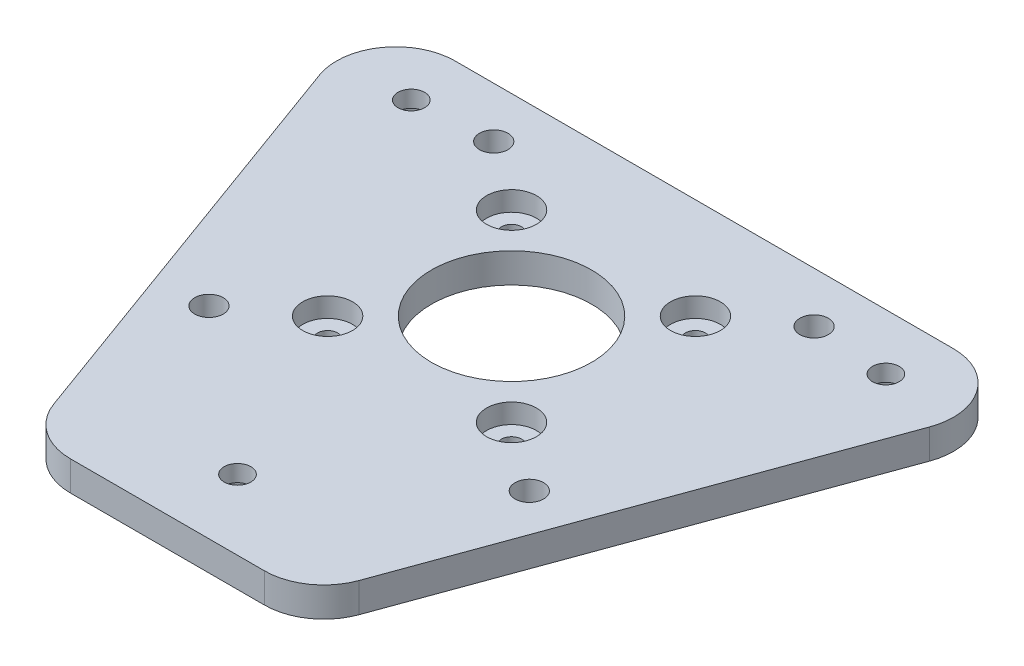
ISO-10303-21;
HEADER;
FILE_DESCRIPTION(('STEP AP214'),'2;1');
FILE_NAME('part.step','',(''),(''),'','','');
FILE_SCHEMA(('AUTOMOTIVE_DESIGN { 1 0 10303 214 1 1 1 1 }'));
ENDSEC;
DATA;
#1=APPLICATION_CONTEXT('core data for automotive mechanical design processes');
#2=APPLICATION_PROTOCOL_DEFINITION('international standard','automotive_design',2000,#1);
#3=PRODUCT_CONTEXT('',#1,'mechanical');
#4=PRODUCT('Part','Part','',(#3));
#5=PRODUCT_RELATED_PRODUCT_CATEGORY('part','',(#4));
#6=PRODUCT_DEFINITION_FORMATION('','',#4);
#7=PRODUCT_DEFINITION_CONTEXT('part definition',#1,'design');
#8=PRODUCT_DEFINITION('design','',#6,#7);
#9=PRODUCT_DEFINITION_SHAPE('','',#8);
#10=(LENGTH_UNIT() NAMED_UNIT(*) SI_UNIT(.MILLI.,.METRE.));
#11=(NAMED_UNIT(*) PLANE_ANGLE_UNIT() SI_UNIT($,.RADIAN.));
#12=(NAMED_UNIT(*) SI_UNIT($,.STERADIAN.) SOLID_ANGLE_UNIT());
#13=UNCERTAINTY_MEASURE_WITH_UNIT(LENGTH_MEASURE(1.E-05),#10,'distance_accuracy_value','');
#14=(GEOMETRIC_REPRESENTATION_CONTEXT(3) GLOBAL_UNCERTAINTY_ASSIGNED_CONTEXT((#13)) GLOBAL_UNIT_ASSIGNED_CONTEXT((#10,
#11,#12)) REPRESENTATION_CONTEXT('',''));
#15=CARTESIAN_POINT('',(0.,0.,0.));
#16=DIRECTION('',(0.,0.,1.));
#17=DIRECTION('',(1.,0.,0.));
#18=AXIS2_PLACEMENT_3D('',#15,#16,#17);
#19=CARTESIAN_POINT('',(0.,5.,0.));
#20=DIRECTION('',(0.,-1.,0.));
#21=DIRECTION('',(0.,0.,-1.));
#22=AXIS2_PLACEMENT_3D('',#19,#20,#21);
#23=PLANE('',#22);
#24=CARTESIAN_POINT('',(0.,5.,46.19));
#25=DIRECTION('',(0.,-1.,0.));
#26=DIRECTION('',(0.,0.,-1.));
#27=AXIS2_PLACEMENT_3D('',#24,#25,#26);
#28=CIRCLE('',#27,2.25);
#29=CARTESIAN_POINT('',(0.,5.,43.94));
#30=VERTEX_POINT('',#29);
#31=EDGE_CURVE('E277',#30,#30,#28,.T.);
#32=ORIENTED_EDGE('',*,*,#31,.T.);
#33=EDGE_LOOP('',(#32));
#34=FACE_BOUND('',#33,.T.);
#35=CARTESIAN_POINT('',(-40.,5.,-23.1));
#36=DIRECTION('',(0.,-1.,0.));
#37=DIRECTION('',(0.,0.,-1.));
#38=AXIS2_PLACEMENT_3D('',#35,#36,#37);
#39=CIRCLE('',#38,2.25);
#40=CARTESIAN_POINT('',(-40.,5.,-25.35));
#41=VERTEX_POINT('',#40);
#42=EDGE_CURVE('E265',#41,#41,#39,.T.);
#43=ORIENTED_EDGE('',*,*,#42,.T.);
#44=EDGE_LOOP('',(#43));
#45=FACE_BOUND('',#44,.T.);
#46=CARTESIAN_POINT('',(40.,5.,-23.1));
#47=DIRECTION('',(0.,-1.,0.));
#48=DIRECTION('',(0.,0.,-1.));
#49=AXIS2_PLACEMENT_3D('',#46,#47,#48);
#50=CIRCLE('',#49,2.25);
#51=CARTESIAN_POINT('',(40.,5.,-25.35));
#52=VERTEX_POINT('',#51);
#53=EDGE_CURVE('E253',#52,#52,#50,.T.);
#54=ORIENTED_EDGE('',*,*,#53,.T.);
#55=EDGE_LOOP('',(#54));
#56=FACE_BOUND('',#55,.T.);
#57=CARTESIAN_POINT('',(-15.5,5.,-15.5));
#58=DIRECTION('',(0.,1.,0.));
#59=DIRECTION('',(0.,0.,1.));
#60=AXIS2_PLACEMENT_3D('',#57,#58,#59);
#61=CIRCLE('',#60,4.2);
#62=CARTESIAN_POINT('',(-15.5,5.,-11.3));
#63=VERTEX_POINT('',#62);
#64=EDGE_CURVE('E250',#63,#63,#61,.T.);
#65=ORIENTED_EDGE('',*,*,#64,.F.);
#66=EDGE_LOOP('',(#65));
#67=FACE_BOUND('',#66,.T.);
#68=CARTESIAN_POINT('',(15.5,5.,-15.5));
#69=DIRECTION('',(0.,1.,0.));
#70=DIRECTION('',(0.,0.,1.));
#71=AXIS2_PLACEMENT_3D('',#68,#69,#70);
#72=CIRCLE('',#71,4.2);
#73=CARTESIAN_POINT('',(15.5,5.,-11.3));
#74=VERTEX_POINT('',#73);
#75=EDGE_CURVE('E238',#74,#74,#72,.T.);
#76=ORIENTED_EDGE('',*,*,#75,.F.);
#77=EDGE_LOOP('',(#76));
#78=FACE_BOUND('',#77,.T.);
#79=CARTESIAN_POINT('',(-15.5,5.,15.5));
#80=DIRECTION('',(0.,1.,0.));
#81=DIRECTION('',(0.,0.,1.));
#82=AXIS2_PLACEMENT_3D('',#79,#80,#81);
#83=CIRCLE('',#82,4.2);
#84=CARTESIAN_POINT('',(-15.5,5.,19.7));
#85=VERTEX_POINT('',#84);
#86=EDGE_CURVE('E214',#85,#85,#83,.T.);
#87=ORIENTED_EDGE('',*,*,#86,.F.);
#88=EDGE_LOOP('',(#87));
#89=FACE_BOUND('',#88,.T.);
#90=CARTESIAN_POINT('',(0.,5.,0.));
#91=DIRECTION('',(0.,1.,0.));
#92=DIRECTION('',(0.,0.,1.));
#93=AXIS2_PLACEMENT_3D('',#90,#91,#92);
#94=CIRCLE('',#93,13.5);
#95=CARTESIAN_POINT('',(0.,5.,13.5));
#96=VERTEX_POINT('',#95);
#97=EDGE_CURVE('E39',#96,#96,#94,.T.);
#98=ORIENTED_EDGE('',*,*,#97,.F.);
#99=EDGE_LOOP('',(#98));
#100=FACE_BOUND('',#99,.T.);
#101=CARTESIAN_POINT('',(-16.3480951115046,5.,48.));
#102=DIRECTION('',(0.,1.,0.));
#103=DIRECTION('',(0.,0.,1.));
#104=AXIS2_PLACEMENT_3D('',#101,#102,#103);
#105=CIRCLE('',#104,10.);
#106=CARTESIAN_POINT('',(-25.7449430600682,5.,51.4204164412504));
#107=VERTEX_POINT('',#106);
#108=CARTESIAN_POINT('',(-16.3480951115045,5.,58.));
#109=VERTEX_POINT('',#108);
#110=EDGE_CURVE('E136',#107,#109,#105,.T.);
#111=ORIENTED_EDGE('',*,*,#110,.T.);
#112=DIRECTION('',(1.,0.,0.));
#113=VECTOR('',#112,1.);
#114=CARTESIAN_POINT('',(-16.3480951115045,5.,58.));
#115=LINE('',#114,#113);
#116=CARTESIAN_POINT('',(16.3480951115045,5.,58.));
#117=VERTEX_POINT('',#116);
#118=EDGE_CURVE('E139',#109,#117,#115,.T.);
#119=ORIENTED_EDGE('',*,*,#118,.T.);
#120=CARTESIAN_POINT('',(16.3480951115046,5.,48.));
#121=DIRECTION('',(0.,1.,0.));
#122=DIRECTION('',(0.,0.,-1.));
#123=AXIS2_PLACEMENT_3D('',#120,#121,#122);
#124=CIRCLE('',#123,10.);
#125=CARTESIAN_POINT('',(25.7449430600682,5.,51.4204164412504));
#126=VERTEX_POINT('',#125);
#127=EDGE_CURVE('E50',#117,#126,#124,.T.);
#128=ORIENTED_EDGE('',*,*,#127,.T.);
#129=DIRECTION('',(0.342041644125043,0.,-0.939684794856359));
#130=VECTOR('',#129,1.);
#131=CARTESIAN_POINT('',(51.4066713787663,5.,-19.0795835587496));
#132=LINE('',#131,#130);
#133=CARTESIAN_POINT('',(51.4066713787663,5.,-19.0795835587496));
#134=VERTEX_POINT('',#133);
#135=EDGE_CURVE('E107',#126,#134,#132,.T.);
#136=ORIENTED_EDGE('',*,*,#135,.T.);
#137=CARTESIAN_POINT('',(42.0098234302028,5.,-22.5000000000001));
#138=DIRECTION('',(0.,1.,0.));
#139=DIRECTION('',(0.,0.,1.));
#140=AXIS2_PLACEMENT_3D('',#137,#138,#139);
#141=CIRCLE('',#140,10.);
#142=CARTESIAN_POINT('',(42.0098234302027,5.,-32.5000000000001));
#143=VERTEX_POINT('',#142);
#144=EDGE_CURVE('E145',#134,#143,#141,.T.);
#145=ORIENTED_EDGE('',*,*,#144,.T.);
#146=DIRECTION('',(-1.,0.,0.));
#147=VECTOR('',#146,1.);
#148=CARTESIAN_POINT('',(-42.0098234302027,5.,-32.5000000000001));
#149=LINE('',#148,#147);
#150=CARTESIAN_POINT('',(-42.0098234302028,5.,-32.5000000000001));
#151=VERTEX_POINT('',#150);
#152=EDGE_CURVE('E148',#143,#151,#149,.T.);
#153=ORIENTED_EDGE('',*,*,#152,.T.);
#154=CARTESIAN_POINT('',(-42.0098234302028,5.,-22.5000000000001));
#155=DIRECTION('',(0.,1.,0.));
#156=DIRECTION('',(0.,0.,-1.));
#157=AXIS2_PLACEMENT_3D('',#154,#155,#156);
#158=CIRCLE('',#157,10.);
#159=CARTESIAN_POINT('',(-51.4066713787663,5.,-19.0795835587496));
#160=VERTEX_POINT('',#159);
#161=EDGE_CURVE('E151',#151,#160,#158,.T.);
#162=ORIENTED_EDGE('',*,*,#161,.T.);
#163=DIRECTION('',(0.342041644125043,0.,0.939684794856359));
#164=VECTOR('',#163,1.);
#165=CARTESIAN_POINT('',(-51.4066713787663,5.,-19.0795835587496));
#166=LINE('',#165,#164);
#167=EDGE_CURVE('E154',#160,#107,#166,.T.);
#168=ORIENTED_EDGE('',*,*,#167,.T.);
#169=EDGE_LOOP('',(#111,#119,#128,#136,#145,#153,#162,#168));
#170=FACE_BOUND('',#169,.T.);
#171=CARTESIAN_POINT('',(-27.,5.,24.));
#172=DIRECTION('',(0.,1.,0.));
#173=DIRECTION('',(0.,0.,1.));
#174=AXIS2_PLACEMENT_3D('',#171,#172,#173);
#175=CIRCLE('',#174,2.4);
#176=CARTESIAN_POINT('',(-27.,5.,26.4));
#177=VERTEX_POINT('',#176);
#178=EDGE_CURVE('E184',#177,#177,#175,.T.);
#179=ORIENTED_EDGE('',*,*,#178,.F.);
#180=EDGE_LOOP('',(#179));
#181=FACE_BOUND('',#180,.T.);
#182=CARTESIAN_POINT('',(27.,5.,24.));
#183=DIRECTION('',(0.,1.,0.));
#184=DIRECTION('',(0.,0.,1.));
#185=AXIS2_PLACEMENT_3D('',#182,#183,#184);
#186=CIRCLE('',#185,2.4);
#187=CARTESIAN_POINT('',(27.,5.,26.4));
#188=VERTEX_POINT('',#187);
#189=EDGE_CURVE('E190',#188,#188,#186,.T.);
#190=ORIENTED_EDGE('',*,*,#189,.F.);
#191=EDGE_LOOP('',(#190));
#192=FACE_BOUND('',#191,.T.);
#193=CARTESIAN_POINT('',(27.,5.,-24.0000000000001));
#194=DIRECTION('',(0.,1.,0.));
#195=DIRECTION('',(0.,0.,1.));
#196=AXIS2_PLACEMENT_3D('',#193,#194,#195);
#197=CIRCLE('',#196,2.4);
#198=CARTESIAN_POINT('',(27.,5.,-21.6000000000001));
#199=VERTEX_POINT('',#198);
#200=EDGE_CURVE('E196',#199,#199,#197,.T.);
#201=ORIENTED_EDGE('',*,*,#200,.F.);
#202=EDGE_LOOP('',(#201));
#203=FACE_BOUND('',#202,.T.);
#204=CARTESIAN_POINT('',(-27.,5.,-24.0000000000001));
#205=DIRECTION('',(0.,1.,0.));
#206=DIRECTION('',(0.,0.,1.));
#207=AXIS2_PLACEMENT_3D('',#204,#205,#206);
#208=CIRCLE('',#207,2.4);
#209=CARTESIAN_POINT('',(-27.,5.,-21.6000000000001));
#210=VERTEX_POINT('',#209);
#211=EDGE_CURVE('E202',#210,#210,#208,.T.);
#212=ORIENTED_EDGE('',*,*,#211,.F.);
#213=EDGE_LOOP('',(#212));
#214=FACE_BOUND('',#213,.T.);
#215=CARTESIAN_POINT('',(15.5,5.,15.5));
#216=DIRECTION('',(0.,1.,0.));
#217=DIRECTION('',(0.,0.,1.));
#218=AXIS2_PLACEMENT_3D('',#215,#216,#217);
#219=CIRCLE('',#218,4.2);
#220=CARTESIAN_POINT('',(15.5,5.,19.7));
#221=VERTEX_POINT('',#220);
#222=EDGE_CURVE('E226',#221,#221,#219,.T.);
#223=ORIENTED_EDGE('',*,*,#222,.F.);
#224=EDGE_LOOP('',(#223));
#225=FACE_BOUND('',#224,.T.);
#226=ADVANCED_FACE('F35',(#34,#45,#56,#67,#78,#89,#100,#170,#181,#192,#203,#214,#225),#23,.F.);
#227=CARTESIAN_POINT('',(0.,0.,0.));
#228=DIRECTION('',(0.,-1.,0.));
#229=DIRECTION('',(0.,0.,-1.));
#230=AXIS2_PLACEMENT_3D('',#227,#228,#229);
#231=PLANE('',#230);
#232=CARTESIAN_POINT('',(0.,0.,46.19));
#233=DIRECTION('',(0.,-1.,0.));
#234=DIRECTION('',(0.,0.,-1.));
#235=AXIS2_PLACEMENT_3D('',#232,#233,#234);
#236=CIRCLE('',#235,4.3);
#237=CARTESIAN_POINT('',(0.,0.,41.89));
#238=VERTEX_POINT('',#237);
#239=EDGE_CURVE('E286',#238,#238,#236,.T.);
#240=ORIENTED_EDGE('',*,*,#239,.F.);
#241=EDGE_LOOP('',(#240));
#242=FACE_BOUND('',#241,.T.);
#243=CARTESIAN_POINT('',(-40.,0.,-23.1));
#244=DIRECTION('',(0.,-1.,0.));
#245=DIRECTION('',(0.,0.,-1.));
#246=AXIS2_PLACEMENT_3D('',#243,#244,#245);
#247=CIRCLE('',#246,4.3);
#248=CARTESIAN_POINT('',(-40.,0.,-27.4));
#249=VERTEX_POINT('',#248);
#250=EDGE_CURVE('E274',#249,#249,#247,.T.);
#251=ORIENTED_EDGE('',*,*,#250,.F.);
#252=EDGE_LOOP('',(#251));
#253=FACE_BOUND('',#252,.T.);
#254=CARTESIAN_POINT('',(40.,0.,-23.1));
#255=DIRECTION('',(0.,-1.,0.));
#256=DIRECTION('',(0.,0.,-1.));
#257=AXIS2_PLACEMENT_3D('',#254,#255,#256);
#258=CIRCLE('',#257,4.3);
#259=CARTESIAN_POINT('',(40.,0.,-27.4));
#260=VERTEX_POINT('',#259);
#261=EDGE_CURVE('E262',#260,#260,#258,.T.);
#262=ORIENTED_EDGE('',*,*,#261,.F.);
#263=EDGE_LOOP('',(#262));
#264=FACE_BOUND('',#263,.T.);
#265=CARTESIAN_POINT('',(-15.5,0.,-15.5));
#266=DIRECTION('',(0.,-1.,0.));
#267=DIRECTION('',(0.,0.,-1.));
#268=AXIS2_PLACEMENT_3D('',#265,#266,#267);
#269=CIRCLE('',#268,1.7);
#270=CARTESIAN_POINT('',(-15.5,0.,-17.2));
#271=VERTEX_POINT('',#270);
#272=EDGE_CURVE('E241',#271,#271,#269,.T.);
#273=ORIENTED_EDGE('',*,*,#272,.F.);
#274=EDGE_LOOP('',(#273));
#275=FACE_BOUND('',#274,.T.);
#276=CARTESIAN_POINT('',(15.5,0.,-15.5));
#277=DIRECTION('',(0.,-1.,0.));
#278=DIRECTION('',(0.,0.,-1.));
#279=AXIS2_PLACEMENT_3D('',#276,#277,#278);
#280=CIRCLE('',#279,1.7);
#281=CARTESIAN_POINT('',(15.5,0.,-17.2));
#282=VERTEX_POINT('',#281);
#283=EDGE_CURVE('E229',#282,#282,#280,.T.);
#284=ORIENTED_EDGE('',*,*,#283,.F.);
#285=EDGE_LOOP('',(#284));
#286=FACE_BOUND('',#285,.T.);
#287=CARTESIAN_POINT('',(15.5,0.,15.5));
#288=DIRECTION('',(0.,-1.,0.));
#289=DIRECTION('',(0.,0.,-1.));
#290=AXIS2_PLACEMENT_3D('',#287,#288,#289);
#291=CIRCLE('',#290,1.7);
#292=CARTESIAN_POINT('',(15.5,0.,13.8));
#293=VERTEX_POINT('',#292);
#294=EDGE_CURVE('E217',#293,#293,#291,.T.);
#295=ORIENTED_EDGE('',*,*,#294,.F.);
#296=EDGE_LOOP('',(#295));
#297=FACE_BOUND('',#296,.T.);
#298=CARTESIAN_POINT('',(-15.5,0.,15.5));
#299=DIRECTION('',(0.,-1.,0.));
#300=DIRECTION('',(0.,0.,-1.));
#301=AXIS2_PLACEMENT_3D('',#298,#299,#300);
#302=CIRCLE('',#301,1.7);
#303=CARTESIAN_POINT('',(-15.5,0.,13.8));
#304=VERTEX_POINT('',#303);
#305=EDGE_CURVE('E205',#304,#304,#302,.T.);
#306=ORIENTED_EDGE('',*,*,#305,.F.);
#307=EDGE_LOOP('',(#306));
#308=FACE_BOUND('',#307,.T.);
#309=CARTESIAN_POINT('',(-27.,0.,-24.0000000000001));
#310=DIRECTION('',(0.,-1.,0.));
#311=DIRECTION('',(0.,0.,-1.));
#312=AXIS2_PLACEMENT_3D('',#309,#310,#311);
#313=CIRCLE('',#312,2.4);
#314=CARTESIAN_POINT('',(-27.,0.,-26.4000000000001));
#315=VERTEX_POINT('',#314);
#316=EDGE_CURVE('E199',#315,#315,#313,.T.);
#317=ORIENTED_EDGE('',*,*,#316,.F.);
#318=EDGE_LOOP('',(#317));
#319=FACE_BOUND('',#318,.T.);
#320=CARTESIAN_POINT('',(27.,0.,-24.0000000000001));
#321=DIRECTION('',(0.,-1.,0.));
#322=DIRECTION('',(0.,0.,-1.));
#323=AXIS2_PLACEMENT_3D('',#320,#321,#322);
#324=CIRCLE('',#323,2.4);
#325=CARTESIAN_POINT('',(27.,0.,-26.4000000000001));
#326=VERTEX_POINT('',#325);
#327=EDGE_CURVE('E193',#326,#326,#324,.T.);
#328=ORIENTED_EDGE('',*,*,#327,.F.);
#329=EDGE_LOOP('',(#328));
#330=FACE_BOUND('',#329,.T.);
#331=CARTESIAN_POINT('',(27.,0.,24.));
#332=DIRECTION('',(0.,-1.,0.));
#333=DIRECTION('',(0.,0.,-1.));
#334=AXIS2_PLACEMENT_3D('',#331,#332,#333);
#335=CIRCLE('',#334,2.4);
#336=CARTESIAN_POINT('',(27.,0.,21.6));
#337=VERTEX_POINT('',#336);
#338=EDGE_CURVE('E187',#337,#337,#335,.T.);
#339=ORIENTED_EDGE('',*,*,#338,.F.);
#340=EDGE_LOOP('',(#339));
#341=FACE_BOUND('',#340,.T.);
#342=CARTESIAN_POINT('',(-27.,0.,24.));
#343=DIRECTION('',(0.,-1.,0.));
#344=DIRECTION('',(0.,0.,-1.));
#345=AXIS2_PLACEMENT_3D('',#342,#343,#344);
#346=CIRCLE('',#345,2.4);
#347=CARTESIAN_POINT('',(-27.,0.,21.6));
#348=VERTEX_POINT('',#347);
#349=EDGE_CURVE('E140',#348,#348,#346,.T.);
#350=ORIENTED_EDGE('',*,*,#349,.F.);
#351=EDGE_LOOP('',(#350));
#352=FACE_BOUND('',#351,.T.);
#353=CARTESIAN_POINT('',(0.,0.,0.));
#354=DIRECTION('',(0.,1.,0.));
#355=DIRECTION('',(0.,0.,1.));
#356=AXIS2_PLACEMENT_3D('',#353,#354,#355);
#357=CIRCLE('',#356,13.5);
#358=CARTESIAN_POINT('',(0.,0.,13.5));
#359=VERTEX_POINT('',#358);
#360=EDGE_CURVE('E11',#359,#359,#357,.T.);
#361=ORIENTED_EDGE('',*,*,#360,.T.);
#362=EDGE_LOOP('',(#361));
#363=FACE_BOUND('',#362,.T.);
#364=DIRECTION('',(1.,0.,0.));
#365=VECTOR('',#364,1.);
#366=CARTESIAN_POINT('',(-16.3480951115045,0.,58.));
#367=LINE('',#366,#365);
#368=CARTESIAN_POINT('',(-16.3480951115045,0.,58.));
#369=VERTEX_POINT('',#368);
#370=CARTESIAN_POINT('',(16.3480951115045,0.,58.));
#371=VERTEX_POINT('',#370);
#372=EDGE_CURVE('E117',#369,#371,#367,.T.);
#373=ORIENTED_EDGE('',*,*,#372,.F.);
#374=CARTESIAN_POINT('',(-16.3480951115046,0.,48.));
#375=DIRECTION('',(0.,1.,0.));
#376=DIRECTION('',(0.,0.,1.));
#377=AXIS2_PLACEMENT_3D('',#374,#375,#376);
#378=CIRCLE('',#377,10.);
#379=CARTESIAN_POINT('',(-25.7449430600682,0.,51.4204164412504));
#380=VERTEX_POINT('',#379);
#381=EDGE_CURVE('E58',#380,#369,#378,.T.);
#382=ORIENTED_EDGE('',*,*,#381,.F.);
#383=DIRECTION('',(0.342041644125043,0.,0.939684794856359));
#384=VECTOR('',#383,1.);
#385=CARTESIAN_POINT('',(-51.4066713787663,0.,-19.0795835587496));
#386=LINE('',#385,#384);
#387=CARTESIAN_POINT('',(-51.4066713787663,0.,-19.0795835587496));
#388=VERTEX_POINT('',#387);
#389=EDGE_CURVE('E132',#388,#380,#386,.T.);
#390=ORIENTED_EDGE('',*,*,#389,.F.);
#391=CARTESIAN_POINT('',(-42.0098234302028,0.,-22.5000000000001));
#392=DIRECTION('',(0.,1.,0.));
#393=DIRECTION('',(0.,0.,-1.));
#394=AXIS2_PLACEMENT_3D('',#391,#392,#393);
#395=CIRCLE('',#394,10.);
#396=CARTESIAN_POINT('',(-42.0098234302028,0.,-32.5000000000001));
#397=VERTEX_POINT('',#396);
#398=EDGE_CURVE('E129',#397,#388,#395,.T.);
#399=ORIENTED_EDGE('',*,*,#398,.F.);
#400=DIRECTION('',(-1.,0.,0.));
#401=VECTOR('',#400,1.);
#402=CARTESIAN_POINT('',(-42.0098234302027,0.,-32.5000000000001));
#403=LINE('',#402,#401);
#404=CARTESIAN_POINT('',(42.0098234302027,0.,-32.5000000000001));
#405=VERTEX_POINT('',#404);
#406=EDGE_CURVE('E123',#405,#397,#403,.T.);
#407=ORIENTED_EDGE('',*,*,#406,.F.);
#408=CARTESIAN_POINT('',(42.0098234302028,0.,-22.5000000000001));
#409=DIRECTION('',(0.,1.,0.));
#410=DIRECTION('',(0.,0.,1.));
#411=AXIS2_PLACEMENT_3D('',#408,#409,#410);
#412=CIRCLE('',#411,10.);
#413=CARTESIAN_POINT('',(51.4066713787663,0.,-19.0795835587496));
#414=VERTEX_POINT('',#413);
#415=EDGE_CURVE('E121',#414,#405,#412,.T.);
#416=ORIENTED_EDGE('',*,*,#415,.F.);
#417=DIRECTION('',(0.342041644125043,0.,-0.939684794856359));
#418=VECTOR('',#417,1.);
#419=CARTESIAN_POINT('',(51.4066713787663,0.,-19.0795835587496));
#420=LINE('',#419,#418);
#421=CARTESIAN_POINT('',(25.7449430600682,0.,51.4204164412504));
#422=VERTEX_POINT('',#421);
#423=EDGE_CURVE('E104',#422,#414,#420,.T.);
#424=ORIENTED_EDGE('',*,*,#423,.F.);
#425=CARTESIAN_POINT('',(16.3480951115046,0.,48.));
#426=DIRECTION('',(0.,1.,0.));
#427=DIRECTION('',(0.,0.,-1.));
#428=AXIS2_PLACEMENT_3D('',#425,#426,#427);
#429=CIRCLE('',#428,10.);
#430=EDGE_CURVE('E112',#371,#422,#429,.T.);
#431=ORIENTED_EDGE('',*,*,#430,.F.);
#432=EDGE_LOOP('',(#373,#382,#390,#399,#407,#416,#424,#431));
#433=FACE_BOUND('',#432,.T.);
#434=ADVANCED_FACE('F37',(#242,#253,#264,#275,#286,#297,#308,#319,#330,#341,#352,#363,#433),
#231,.T.);
#435=CARTESIAN_POINT('',(0.,0.,0.));
#436=DIRECTION('',(0.,1.,0.));
#437=DIRECTION('',(0.,0.,1.));
#438=AXIS2_PLACEMENT_3D('',#435,#436,#437);
#439=CYLINDRICAL_SURFACE('',#438,13.5);
#440=ORIENTED_EDGE('',*,*,#360,.F.);
#441=EDGE_LOOP('',(#440));
#442=FACE_BOUND('',#441,.T.);
#443=ORIENTED_EDGE('',*,*,#97,.T.);
#444=EDGE_LOOP('',(#443));
#445=FACE_BOUND('',#444,.T.);
#446=ADVANCED_FACE('F294',(#442,#445),#439,.F.);
#447=CARTESIAN_POINT('',(-16.3480951115046,0.,48.));
#448=DIRECTION('',(0.,1.,0.));
#449=DIRECTION('',(0.,0.,1.));
#450=AXIS2_PLACEMENT_3D('',#447,#448,#449);
#451=CYLINDRICAL_SURFACE('',#450,10.);
#452=ORIENTED_EDGE('',*,*,#110,.F.);
#453=DIRECTION('',(0.,1.,0.));
#454=VECTOR('',#453,1.);
#455=CARTESIAN_POINT('',(-25.7449430600682,0.,51.4204164412504));
#456=LINE('',#455,#454);
#457=EDGE_CURVE('E157',#380,#107,#456,.T.);
#458=ORIENTED_EDGE('',*,*,#457,.F.);
#459=ORIENTED_EDGE('',*,*,#381,.T.);
#460=DIRECTION('',(0.,1.,0.));
#461=VECTOR('',#460,1.);
#462=CARTESIAN_POINT('',(-16.3480951115045,0.,58.));
#463=LINE('',#462,#461);
#464=EDGE_CURVE('E135',#369,#109,#463,.T.);
#465=ORIENTED_EDGE('',*,*,#464,.T.);
#466=EDGE_LOOP('',(#452,#458,#459,#465));
#467=FACE_BOUND('',#466,.T.);
#468=ADVANCED_FACE('F169',(#467),#451,.T.);
#469=CARTESIAN_POINT('',(-51.4066713787663,0.,-19.0795835587496));
#470=DIRECTION('',(-0.939684794856359,0.,0.342041644125043));
#471=DIRECTION('',(0.342041644125043,0.,0.939684794856359));
#472=AXIS2_PLACEMENT_3D('',#469,#470,#471);
#473=PLANE('',#472);
#474=ORIENTED_EDGE('',*,*,#167,.F.);
#475=DIRECTION('',(0.,1.,0.));
#476=VECTOR('',#475,1.);
#477=CARTESIAN_POINT('',(-51.4066713787663,0.,-19.0795835587496));
#478=LINE('',#477,#476);
#479=EDGE_CURVE('E159',#388,#160,#478,.T.);
#480=ORIENTED_EDGE('',*,*,#479,.F.);
#481=ORIENTED_EDGE('',*,*,#389,.T.);
#482=ORIENTED_EDGE('',*,*,#457,.T.);
#483=EDGE_LOOP('',(#474,#480,#481,#482));
#484=FACE_BOUND('',#483,.T.);
#485=ADVANCED_FACE('F177',(#484),#473,.T.);
#486=CARTESIAN_POINT('',(-42.0098234302028,0.,-22.5000000000001));
#487=DIRECTION('',(0.,1.,0.));
#488=DIRECTION('',(0.,0.,1.));
#489=AXIS2_PLACEMENT_3D('',#486,#487,#488);
#490=CYLINDRICAL_SURFACE('',#489,10.);
#491=ORIENTED_EDGE('',*,*,#161,.F.);
#492=DIRECTION('',(0.,1.,0.));
#493=VECTOR('',#492,1.);
#494=CARTESIAN_POINT('',(-42.0098234302028,0.,-32.5000000000001));
#495=LINE('',#494,#493);
#496=EDGE_CURVE('E161',#397,#151,#495,.T.);
#497=ORIENTED_EDGE('',*,*,#496,.F.);
#498=ORIENTED_EDGE('',*,*,#398,.T.);
#499=ORIENTED_EDGE('',*,*,#479,.T.);
#500=EDGE_LOOP('',(#491,#497,#498,#499));
#501=FACE_BOUND('',#500,.T.);
#502=ADVANCED_FACE('F345',(#501),#490,.T.);
#503=CARTESIAN_POINT('',(-42.0098234302027,0.,-32.5000000000001));
#504=DIRECTION('',(0.,0.,-1.));
#505=DIRECTION('',(-1.,0.,0.));
#506=AXIS2_PLACEMENT_3D('',#503,#504,#505);
#507=PLANE('',#506);
#508=ORIENTED_EDGE('',*,*,#152,.F.);
#509=DIRECTION('',(0.,1.,0.));
#510=VECTOR('',#509,1.);
#511=CARTESIAN_POINT('',(42.0098234302027,0.,-32.5000000000001));
#512=LINE('',#511,#510);
#513=EDGE_CURVE('E163',#405,#143,#512,.T.);
#514=ORIENTED_EDGE('',*,*,#513,.F.);
#515=ORIENTED_EDGE('',*,*,#406,.T.);
#516=ORIENTED_EDGE('',*,*,#496,.T.);
#517=EDGE_LOOP('',(#508,#514,#515,#516));
#518=FACE_BOUND('',#517,.T.);
#519=ADVANCED_FACE('F341',(#518),#507,.T.);
#520=CARTESIAN_POINT('',(42.0098234302028,0.,-22.5000000000001));
#521=DIRECTION('',(0.,1.,0.));
#522=DIRECTION('',(0.,0.,1.));
#523=AXIS2_PLACEMENT_3D('',#520,#521,#522);
#524=CYLINDRICAL_SURFACE('',#523,10.);
#525=ORIENTED_EDGE('',*,*,#144,.F.);
#526=DIRECTION('',(0.,1.,0.));
#527=VECTOR('',#526,1.);
#528=CARTESIAN_POINT('',(51.4066713787663,0.,-19.0795835587496));
#529=LINE('',#528,#527);
#530=EDGE_CURVE('E108',#414,#134,#529,.T.);
#531=ORIENTED_EDGE('',*,*,#530,.F.);
#532=ORIENTED_EDGE('',*,*,#415,.T.);
#533=ORIENTED_EDGE('',*,*,#513,.T.);
#534=EDGE_LOOP('',(#525,#531,#532,#533));
#535=FACE_BOUND('',#534,.T.);
#536=ADVANCED_FACE('F338',(#535),#524,.T.);
#537=CARTESIAN_POINT('',(51.4066713787663,0.,-19.0795835587496));
#538=DIRECTION('',(0.939684794856359,0.,0.342041644125043));
#539=DIRECTION('',(0.342041644125043,0.,-0.939684794856359));
#540=AXIS2_PLACEMENT_3D('',#537,#538,#539);
#541=PLANE('',#540);
#542=ORIENTED_EDGE('',*,*,#135,.F.);
#543=DIRECTION('',(0.,1.,0.));
#544=VECTOR('',#543,1.);
#545=CARTESIAN_POINT('',(25.7449430600682,0.,51.4204164412504));
#546=LINE('',#545,#544);
#547=EDGE_CURVE('E100',#422,#126,#546,.T.);
#548=ORIENTED_EDGE('',*,*,#547,.F.);
#549=ORIENTED_EDGE('',*,*,#423,.T.);
#550=ORIENTED_EDGE('',*,*,#530,.T.);
#551=EDGE_LOOP('',(#542,#548,#549,#550));
#552=FACE_BOUND('',#551,.T.);
#553=ADVANCED_FACE('F102',(#552),#541,.T.);
#554=CARTESIAN_POINT('',(16.3480951115046,0.,48.));
#555=DIRECTION('',(0.,1.,0.));
#556=DIRECTION('',(0.,0.,1.));
#557=AXIS2_PLACEMENT_3D('',#554,#555,#556);
#558=CYLINDRICAL_SURFACE('',#557,10.);
#559=ORIENTED_EDGE('',*,*,#127,.F.);
#560=DIRECTION('',(0.,1.,0.));
#561=VECTOR('',#560,1.);
#562=CARTESIAN_POINT('',(16.3480951115045,0.,58.));
#563=LINE('',#562,#561);
#564=EDGE_CURVE('E109',#371,#117,#563,.T.);
#565=ORIENTED_EDGE('',*,*,#564,.F.);
#566=ORIENTED_EDGE('',*,*,#430,.T.);
#567=ORIENTED_EDGE('',*,*,#547,.T.);
#568=EDGE_LOOP('',(#559,#565,#566,#567));
#569=FACE_BOUND('',#568,.T.);
#570=ADVANCED_FACE('F113',(#569),#558,.T.);
#571=CARTESIAN_POINT('',(-16.3480951115045,0.,58.));
#572=DIRECTION('',(0.,0.,1.));
#573=DIRECTION('',(1.,0.,0.));
#574=AXIS2_PLACEMENT_3D('',#571,#572,#573);
#575=PLANE('',#574);
#576=ORIENTED_EDGE('',*,*,#118,.F.);
#577=ORIENTED_EDGE('',*,*,#464,.F.);
#578=ORIENTED_EDGE('',*,*,#372,.T.);
#579=ORIENTED_EDGE('',*,*,#564,.T.);
#580=EDGE_LOOP('',(#576,#577,#578,#579));
#581=FACE_BOUND('',#580,.T.);
#582=ADVANCED_FACE('F171',(#581),#575,.T.);
#583=CARTESIAN_POINT('',(-27.,5.,24.));
#584=DIRECTION('',(0.,1.,0.));
#585=DIRECTION('',(0.,0.,1.));
#586=AXIS2_PLACEMENT_3D('',#583,#584,#585);
#587=CYLINDRICAL_SURFACE('',#586,2.4);
#588=ORIENTED_EDGE('',*,*,#178,.T.);
#589=EDGE_LOOP('',(#588));
#590=FACE_BOUND('',#589,.T.);
#591=ORIENTED_EDGE('',*,*,#349,.T.);
#592=EDGE_LOOP('',(#591));
#593=FACE_BOUND('',#592,.T.);
#594=ADVANCED_FACE('F333',(#590,#593),#587,.F.);
#595=CARTESIAN_POINT('',(27.,5.,24.));
#596=DIRECTION('',(0.,1.,0.));
#597=DIRECTION('',(0.,0.,1.));
#598=AXIS2_PLACEMENT_3D('',#595,#596,#597);
#599=CYLINDRICAL_SURFACE('',#598,2.4);
#600=ORIENTED_EDGE('',*,*,#189,.T.);
#601=EDGE_LOOP('',(#600));
#602=FACE_BOUND('',#601,.T.);
#603=ORIENTED_EDGE('',*,*,#338,.T.);
#604=EDGE_LOOP('',(#603));
#605=FACE_BOUND('',#604,.T.);
#606=ADVANCED_FACE('F354',(#602,#605),#599,.F.);
#607=CARTESIAN_POINT('',(27.,5.,-24.0000000000001));
#608=DIRECTION('',(0.,1.,0.));
#609=DIRECTION('',(0.,0.,1.));
#610=AXIS2_PLACEMENT_3D('',#607,#608,#609);
#611=CYLINDRICAL_SURFACE('',#610,2.4);
#612=ORIENTED_EDGE('',*,*,#200,.T.);
#613=EDGE_LOOP('',(#612));
#614=FACE_BOUND('',#613,.T.);
#615=ORIENTED_EDGE('',*,*,#327,.T.);
#616=EDGE_LOOP('',(#615));
#617=FACE_BOUND('',#616,.T.);
#618=ADVANCED_FACE('F358',(#614,#617),#611,.F.);
#619=CARTESIAN_POINT('',(-27.,5.,-24.0000000000001));
#620=DIRECTION('',(0.,1.,0.));
#621=DIRECTION('',(0.,0.,1.));
#622=AXIS2_PLACEMENT_3D('',#619,#620,#621);
#623=CYLINDRICAL_SURFACE('',#622,2.4);
#624=ORIENTED_EDGE('',*,*,#211,.T.);
#625=EDGE_LOOP('',(#624));
#626=FACE_BOUND('',#625,.T.);
#627=ORIENTED_EDGE('',*,*,#316,.T.);
#628=EDGE_LOOP('',(#627));
#629=FACE_BOUND('',#628,.T.);
#630=ADVANCED_FACE('F362',(#626,#629),#623,.F.);
#631=CARTESIAN_POINT('',(-15.5,5.,15.5));
#632=DIRECTION('',(0.,1.,0.));
#633=DIRECTION('',(0.,0.,1.));
#634=AXIS2_PLACEMENT_3D('',#631,#632,#633);
#635=CYLINDRICAL_SURFACE('',#634,1.7);
#636=CARTESIAN_POINT('',(-15.5,1.7,15.5));
#637=DIRECTION('',(0.,1.,0.));
#638=DIRECTION('',(0.,0.,1.));
#639=AXIS2_PLACEMENT_3D('',#636,#637,#638);
#640=CIRCLE('',#639,1.7);
#641=CARTESIAN_POINT('',(-15.5,1.7,17.2));
#642=VERTEX_POINT('',#641);
#643=EDGE_CURVE('E208',#642,#642,#640,.T.);
#644=ORIENTED_EDGE('',*,*,#643,.T.);
#645=EDGE_LOOP('',(#644));
#646=FACE_BOUND('',#645,.T.);
#647=ORIENTED_EDGE('',*,*,#305,.T.);
#648=EDGE_LOOP('',(#647));
#649=FACE_BOUND('',#648,.T.);
#650=ADVANCED_FACE('F366',(#646,#649),#635,.F.);
#651=CARTESIAN_POINT('',(-13.8,1.7,15.5));
#652=DIRECTION('',(0.,-1.,0.));
#653=DIRECTION('',(0.,0.,-1.));
#654=AXIS2_PLACEMENT_3D('',#651,#652,#653);
#655=PLANE('',#654);
#656=ORIENTED_EDGE('',*,*,#643,.F.);
#657=EDGE_LOOP('',(#656));
#658=FACE_BOUND('',#657,.T.);
#659=CARTESIAN_POINT('',(-15.5,1.7,15.5));
#660=DIRECTION('',(0.,1.,0.));
#661=DIRECTION('',(0.,0.,1.));
#662=AXIS2_PLACEMENT_3D('',#659,#660,#661);
#663=CIRCLE('',#662,4.2);
#664=CARTESIAN_POINT('',(-15.5,1.7,19.7));
#665=VERTEX_POINT('',#664);
#666=EDGE_CURVE('E211',#665,#665,#663,.T.);
#667=ORIENTED_EDGE('',*,*,#666,.T.);
#668=EDGE_LOOP('',(#667));
#669=FACE_BOUND('',#668,.T.);
#670=ADVANCED_FACE('F370',(#658,#669),#655,.F.);
#671=CARTESIAN_POINT('',(-15.5,5.,15.5));
#672=DIRECTION('',(0.,1.,0.));
#673=DIRECTION('',(0.,0.,1.));
#674=AXIS2_PLACEMENT_3D('',#671,#672,#673);
#675=CYLINDRICAL_SURFACE('',#674,4.2);
#676=ORIENTED_EDGE('',*,*,#666,.F.);
#677=EDGE_LOOP('',(#676));
#678=FACE_BOUND('',#677,.T.);
#679=ORIENTED_EDGE('',*,*,#86,.T.);
#680=EDGE_LOOP('',(#679));
#681=FACE_BOUND('',#680,.T.);
#682=ADVANCED_FACE('F374',(#678,#681),#675,.F.);
#683=CARTESIAN_POINT('',(15.5,5.,15.5));
#684=DIRECTION('',(0.,1.,0.));
#685=DIRECTION('',(0.,0.,1.));
#686=AXIS2_PLACEMENT_3D('',#683,#684,#685);
#687=CYLINDRICAL_SURFACE('',#686,1.7);
#688=CARTESIAN_POINT('',(15.5,1.7,15.5));
#689=DIRECTION('',(0.,1.,0.));
#690=DIRECTION('',(0.,0.,1.));
#691=AXIS2_PLACEMENT_3D('',#688,#689,#690);
#692=CIRCLE('',#691,1.7);
#693=CARTESIAN_POINT('',(15.5,1.7,17.2));
#694=VERTEX_POINT('',#693);
#695=EDGE_CURVE('E220',#694,#694,#692,.T.);
#696=ORIENTED_EDGE('',*,*,#695,.T.);
#697=EDGE_LOOP('',(#696));
#698=FACE_BOUND('',#697,.T.);
#699=ORIENTED_EDGE('',*,*,#294,.T.);
#700=EDGE_LOOP('',(#699));
#701=FACE_BOUND('',#700,.T.);
#702=ADVANCED_FACE('F378',(#698,#701),#687,.F.);
#703=CARTESIAN_POINT('',(17.2,1.7,15.5));
#704=DIRECTION('',(0.,-1.,0.));
#705=DIRECTION('',(0.,0.,-1.));
#706=AXIS2_PLACEMENT_3D('',#703,#704,#705);
#707=PLANE('',#706);
#708=ORIENTED_EDGE('',*,*,#695,.F.);
#709=EDGE_LOOP('',(#708));
#710=FACE_BOUND('',#709,.T.);
#711=CARTESIAN_POINT('',(15.5,1.7,15.5));
#712=DIRECTION('',(0.,1.,0.));
#713=DIRECTION('',(0.,0.,1.));
#714=AXIS2_PLACEMENT_3D('',#711,#712,#713);
#715=CIRCLE('',#714,4.2);
#716=CARTESIAN_POINT('',(15.5,1.7,19.7));
#717=VERTEX_POINT('',#716);
#718=EDGE_CURVE('E223',#717,#717,#715,.T.);
#719=ORIENTED_EDGE('',*,*,#718,.T.);
#720=EDGE_LOOP('',(#719));
#721=FACE_BOUND('',#720,.T.);
#722=ADVANCED_FACE('F382',(#710,#721),#707,.F.);
#723=CARTESIAN_POINT('',(15.5,5.,15.5));
#724=DIRECTION('',(0.,1.,0.));
#725=DIRECTION('',(0.,0.,1.));
#726=AXIS2_PLACEMENT_3D('',#723,#724,#725);
#727=CYLINDRICAL_SURFACE('',#726,4.2);
#728=ORIENTED_EDGE('',*,*,#718,.F.);
#729=EDGE_LOOP('',(#728));
#730=FACE_BOUND('',#729,.T.);
#731=ORIENTED_EDGE('',*,*,#222,.T.);
#732=EDGE_LOOP('',(#731));
#733=FACE_BOUND('',#732,.T.);
#734=ADVANCED_FACE('F386',(#730,#733),#727,.F.);
#735=CARTESIAN_POINT('',(15.5,5.,-15.5));
#736=DIRECTION('',(0.,1.,0.));
#737=DIRECTION('',(0.,0.,1.));
#738=AXIS2_PLACEMENT_3D('',#735,#736,#737);
#739=CYLINDRICAL_SURFACE('',#738,1.7);
#740=CARTESIAN_POINT('',(15.5,1.7,-15.5));
#741=DIRECTION('',(0.,1.,0.));
#742=DIRECTION('',(0.,0.,1.));
#743=AXIS2_PLACEMENT_3D('',#740,#741,#742);
#744=CIRCLE('',#743,1.7);
#745=CARTESIAN_POINT('',(15.5,1.7,-13.8));
#746=VERTEX_POINT('',#745);
#747=EDGE_CURVE('E232',#746,#746,#744,.T.);
#748=ORIENTED_EDGE('',*,*,#747,.T.);
#749=EDGE_LOOP('',(#748));
#750=FACE_BOUND('',#749,.T.);
#751=ORIENTED_EDGE('',*,*,#283,.T.);
#752=EDGE_LOOP('',(#751));
#753=FACE_BOUND('',#752,.T.);
#754=ADVANCED_FACE('F390',(#750,#753),#739,.F.);
#755=CARTESIAN_POINT('',(17.2,1.7,-15.5));
#756=DIRECTION('',(0.,-1.,0.));
#757=DIRECTION('',(0.,0.,-1.));
#758=AXIS2_PLACEMENT_3D('',#755,#756,#757);
#759=PLANE('',#758);
#760=ORIENTED_EDGE('',*,*,#747,.F.);
#761=EDGE_LOOP('',(#760));
#762=FACE_BOUND('',#761,.T.);
#763=CARTESIAN_POINT('',(15.5,1.7,-15.5));
#764=DIRECTION('',(0.,1.,0.));
#765=DIRECTION('',(0.,0.,1.));
#766=AXIS2_PLACEMENT_3D('',#763,#764,#765);
#767=CIRCLE('',#766,4.2);
#768=CARTESIAN_POINT('',(15.5,1.7,-11.3));
#769=VERTEX_POINT('',#768);
#770=EDGE_CURVE('E235',#769,#769,#767,.T.);
#771=ORIENTED_EDGE('',*,*,#770,.T.);
#772=EDGE_LOOP('',(#771));
#773=FACE_BOUND('',#772,.T.);
#774=ADVANCED_FACE('F394',(#762,#773),#759,.F.);
#775=CARTESIAN_POINT('',(15.5,5.,-15.5));
#776=DIRECTION('',(0.,1.,0.));
#777=DIRECTION('',(0.,0.,1.));
#778=AXIS2_PLACEMENT_3D('',#775,#776,#777);
#779=CYLINDRICAL_SURFACE('',#778,4.2);
#780=ORIENTED_EDGE('',*,*,#770,.F.);
#781=EDGE_LOOP('',(#780));
#782=FACE_BOUND('',#781,.T.);
#783=ORIENTED_EDGE('',*,*,#75,.T.);
#784=EDGE_LOOP('',(#783));
#785=FACE_BOUND('',#784,.T.);
#786=ADVANCED_FACE('F398',(#782,#785),#779,.F.);
#787=CARTESIAN_POINT('',(-15.5,5.,-15.5));
#788=DIRECTION('',(0.,1.,0.));
#789=DIRECTION('',(0.,0.,1.));
#790=AXIS2_PLACEMENT_3D('',#787,#788,#789);
#791=CYLINDRICAL_SURFACE('',#790,1.7);
#792=CARTESIAN_POINT('',(-15.5,1.7,-15.5));
#793=DIRECTION('',(0.,1.,0.));
#794=DIRECTION('',(0.,0.,1.));
#795=AXIS2_PLACEMENT_3D('',#792,#793,#794);
#796=CIRCLE('',#795,1.7);
#797=CARTESIAN_POINT('',(-15.5,1.7,-13.8));
#798=VERTEX_POINT('',#797);
#799=EDGE_CURVE('E244',#798,#798,#796,.T.);
#800=ORIENTED_EDGE('',*,*,#799,.T.);
#801=EDGE_LOOP('',(#800));
#802=FACE_BOUND('',#801,.T.);
#803=ORIENTED_EDGE('',*,*,#272,.T.);
#804=EDGE_LOOP('',(#803));
#805=FACE_BOUND('',#804,.T.);
#806=ADVANCED_FACE('F402',(#802,#805),#791,.F.);
#807=CARTESIAN_POINT('',(-13.8,1.7,-15.5));
#808=DIRECTION('',(0.,-1.,0.));
#809=DIRECTION('',(0.,0.,-1.));
#810=AXIS2_PLACEMENT_3D('',#807,#808,#809);
#811=PLANE('',#810);
#812=ORIENTED_EDGE('',*,*,#799,.F.);
#813=EDGE_LOOP('',(#812));
#814=FACE_BOUND('',#813,.T.);
#815=CARTESIAN_POINT('',(-15.5,1.7,-15.5));
#816=DIRECTION('',(0.,1.,0.));
#817=DIRECTION('',(0.,0.,1.));
#818=AXIS2_PLACEMENT_3D('',#815,#816,#817);
#819=CIRCLE('',#818,4.2);
#820=CARTESIAN_POINT('',(-15.5,1.7,-11.3));
#821=VERTEX_POINT('',#820);
#822=EDGE_CURVE('E247',#821,#821,#819,.T.);
#823=ORIENTED_EDGE('',*,*,#822,.T.);
#824=EDGE_LOOP('',(#823));
#825=FACE_BOUND('',#824,.T.);
#826=ADVANCED_FACE('F406',(#814,#825),#811,.F.);
#827=CARTESIAN_POINT('',(-15.5,5.,-15.5));
#828=DIRECTION('',(0.,1.,0.));
#829=DIRECTION('',(0.,0.,1.));
#830=AXIS2_PLACEMENT_3D('',#827,#828,#829);
#831=CYLINDRICAL_SURFACE('',#830,4.2);
#832=ORIENTED_EDGE('',*,*,#822,.F.);
#833=EDGE_LOOP('',(#832));
#834=FACE_BOUND('',#833,.T.);
#835=ORIENTED_EDGE('',*,*,#64,.T.);
#836=EDGE_LOOP('',(#835));
#837=FACE_BOUND('',#836,.T.);
#838=ADVANCED_FACE('F410',(#834,#837),#831,.F.);
#839=CARTESIAN_POINT('',(40.,0.,-23.1));
#840=DIRECTION('',(0.,-1.,0.));
#841=DIRECTION('',(0.,0.,-1.));
#842=AXIS2_PLACEMENT_3D('',#839,#840,#841);
#843=CYLINDRICAL_SURFACE('',#842,2.25);
#844=ORIENTED_EDGE('',*,*,#53,.F.);
#845=EDGE_LOOP('',(#844));
#846=FACE_BOUND('',#845,.T.);
#847=CARTESIAN_POINT('',(40.,2.2,-23.1));
#848=DIRECTION('',(0.,-1.,0.));
#849=DIRECTION('',(0.,0.,-1.));
#850=AXIS2_PLACEMENT_3D('',#847,#848,#849);
#851=CIRCLE('',#850,2.25);
#852=CARTESIAN_POINT('',(40.,2.2,-25.35));
#853=VERTEX_POINT('',#852);
#854=EDGE_CURVE('E256',#853,#853,#851,.T.);
#855=ORIENTED_EDGE('',*,*,#854,.T.);
#856=EDGE_LOOP('',(#855));
#857=FACE_BOUND('',#856,.T.);
#858=ADVANCED_FACE('F414',(#846,#857),#843,.F.);
#859=CARTESIAN_POINT('',(42.25,2.2,-23.1));
#860=DIRECTION('',(0.,1.,0.));
#861=DIRECTION('',(0.,0.,1.));
#862=AXIS2_PLACEMENT_3D('',#859,#860,#861);
#863=PLANE('',#862);
#864=ORIENTED_EDGE('',*,*,#854,.F.);
#865=EDGE_LOOP('',(#864));
#866=FACE_BOUND('',#865,.T.);
#867=CARTESIAN_POINT('',(40.,2.2,-23.1));
#868=DIRECTION('',(0.,-1.,0.));
#869=DIRECTION('',(0.,0.,-1.));
#870=AXIS2_PLACEMENT_3D('',#867,#868,#869);
#871=CIRCLE('',#870,4.3);
#872=CARTESIAN_POINT('',(40.,2.2,-27.4));
#873=VERTEX_POINT('',#872);
#874=EDGE_CURVE('E259',#873,#873,#871,.T.);
#875=ORIENTED_EDGE('',*,*,#874,.T.);
#876=EDGE_LOOP('',(#875));
#877=FACE_BOUND('',#876,.T.);
#878=ADVANCED_FACE('F418',(#866,#877),#863,.F.);
#879=CARTESIAN_POINT('',(40.,0.,-23.1));
#880=DIRECTION('',(0.,-1.,0.));
#881=DIRECTION('',(0.,0.,-1.));
#882=AXIS2_PLACEMENT_3D('',#879,#880,#881);
#883=CYLINDRICAL_SURFACE('',#882,4.3);
#884=ORIENTED_EDGE('',*,*,#874,.F.);
#885=EDGE_LOOP('',(#884));
#886=FACE_BOUND('',#885,.T.);
#887=ORIENTED_EDGE('',*,*,#261,.T.);
#888=EDGE_LOOP('',(#887));
#889=FACE_BOUND('',#888,.T.);
#890=ADVANCED_FACE('F422',(#886,#889),#883,.F.);
#891=CARTESIAN_POINT('',(-40.,0.,-23.1));
#892=DIRECTION('',(0.,-1.,0.));
#893=DIRECTION('',(0.,0.,-1.));
#894=AXIS2_PLACEMENT_3D('',#891,#892,#893);
#895=CYLINDRICAL_SURFACE('',#894,2.25);
#896=ORIENTED_EDGE('',*,*,#42,.F.);
#897=EDGE_LOOP('',(#896));
#898=FACE_BOUND('',#897,.T.);
#899=CARTESIAN_POINT('',(-40.,2.2,-23.1));
#900=DIRECTION('',(0.,-1.,0.));
#901=DIRECTION('',(0.,0.,-1.));
#902=AXIS2_PLACEMENT_3D('',#899,#900,#901);
#903=CIRCLE('',#902,2.25);
#904=CARTESIAN_POINT('',(-40.,2.2,-25.35));
#905=VERTEX_POINT('',#904);
#906=EDGE_CURVE('E268',#905,#905,#903,.T.);
#907=ORIENTED_EDGE('',*,*,#906,.T.);
#908=EDGE_LOOP('',(#907));
#909=FACE_BOUND('',#908,.T.);
#910=ADVANCED_FACE('F426',(#898,#909),#895,.F.);
#911=CARTESIAN_POINT('',(-37.75,2.2,-23.1));
#912=DIRECTION('',(0.,1.,0.));
#913=DIRECTION('',(0.,0.,1.));
#914=AXIS2_PLACEMENT_3D('',#911,#912,#913);
#915=PLANE('',#914);
#916=ORIENTED_EDGE('',*,*,#906,.F.);
#917=EDGE_LOOP('',(#916));
#918=FACE_BOUND('',#917,.T.);
#919=CARTESIAN_POINT('',(-40.,2.2,-23.1));
#920=DIRECTION('',(0.,-1.,0.));
#921=DIRECTION('',(0.,0.,-1.));
#922=AXIS2_PLACEMENT_3D('',#919,#920,#921);
#923=CIRCLE('',#922,4.3);
#924=CARTESIAN_POINT('',(-40.,2.2,-27.4));
#925=VERTEX_POINT('',#924);
#926=EDGE_CURVE('E271',#925,#925,#923,.T.);
#927=ORIENTED_EDGE('',*,*,#926,.T.);
#928=EDGE_LOOP('',(#927));
#929=FACE_BOUND('',#928,.T.);
#930=ADVANCED_FACE('F430',(#918,#929),#915,.F.);
#931=CARTESIAN_POINT('',(-40.,0.,-23.1));
#932=DIRECTION('',(0.,-1.,0.));
#933=DIRECTION('',(0.,0.,-1.));
#934=AXIS2_PLACEMENT_3D('',#931,#932,#933);
#935=CYLINDRICAL_SURFACE('',#934,4.3);
#936=ORIENTED_EDGE('',*,*,#926,.F.);
#937=EDGE_LOOP('',(#936));
#938=FACE_BOUND('',#937,.T.);
#939=ORIENTED_EDGE('',*,*,#250,.T.);
#940=EDGE_LOOP('',(#939));
#941=FACE_BOUND('',#940,.T.);
#942=ADVANCED_FACE('F434',(#938,#941),#935,.F.);
#943=CARTESIAN_POINT('',(0.,0.,46.19));
#944=DIRECTION('',(0.,-1.,0.));
#945=DIRECTION('',(0.,0.,-1.));
#946=AXIS2_PLACEMENT_3D('',#943,#944,#945);
#947=CYLINDRICAL_SURFACE('',#946,2.25);
#948=ORIENTED_EDGE('',*,*,#31,.F.);
#949=EDGE_LOOP('',(#948));
#950=FACE_BOUND('',#949,.T.);
#951=CARTESIAN_POINT('',(0.,2.2,46.19));
#952=DIRECTION('',(0.,-1.,0.));
#953=DIRECTION('',(0.,0.,-1.));
#954=AXIS2_PLACEMENT_3D('',#951,#952,#953);
#955=CIRCLE('',#954,2.25);
#956=CARTESIAN_POINT('',(0.,2.2,43.94));
#957=VERTEX_POINT('',#956);
#958=EDGE_CURVE('E280',#957,#957,#955,.T.);
#959=ORIENTED_EDGE('',*,*,#958,.T.);
#960=EDGE_LOOP('',(#959));
#961=FACE_BOUND('',#960,.T.);
#962=ADVANCED_FACE('F438',(#950,#961),#947,.F.);
#963=CARTESIAN_POINT('',(2.25,2.2,46.19));
#964=DIRECTION('',(0.,1.,0.));
#965=DIRECTION('',(0.,0.,1.));
#966=AXIS2_PLACEMENT_3D('',#963,#964,#965);
#967=PLANE('',#966);
#968=ORIENTED_EDGE('',*,*,#958,.F.);
#969=EDGE_LOOP('',(#968));
#970=FACE_BOUND('',#969,.T.);
#971=CARTESIAN_POINT('',(0.,2.2,46.19));
#972=DIRECTION('',(0.,-1.,0.));
#973=DIRECTION('',(0.,0.,-1.));
#974=AXIS2_PLACEMENT_3D('',#971,#972,#973);
#975=CIRCLE('',#974,4.3);
#976=CARTESIAN_POINT('',(0.,2.2,41.89));
#977=VERTEX_POINT('',#976);
#978=EDGE_CURVE('E283',#977,#977,#975,.T.);
#979=ORIENTED_EDGE('',*,*,#978,.T.);
#980=EDGE_LOOP('',(#979));
#981=FACE_BOUND('',#980,.T.);
#982=ADVANCED_FACE('F442',(#970,#981),#967,.F.);
#983=CARTESIAN_POINT('',(0.,0.,46.19));
#984=DIRECTION('',(0.,-1.,0.));
#985=DIRECTION('',(0.,0.,-1.));
#986=AXIS2_PLACEMENT_3D('',#983,#984,#985);
#987=CYLINDRICAL_SURFACE('',#986,4.3);
#988=ORIENTED_EDGE('',*,*,#978,.F.);
#989=EDGE_LOOP('',(#988));
#990=FACE_BOUND('',#989,.T.);
#991=ORIENTED_EDGE('',*,*,#239,.T.);
#992=EDGE_LOOP('',(#991));
#993=FACE_BOUND('',#992,.T.);
#994=ADVANCED_FACE('F290',(#990,#993),#987,.F.);
#995=CLOSED_SHELL('',(#226,#434,#446,#468,#485,#502,#519,#536,#553,#570,#582,#594,#606,#618,
#630,#650,#670,#682,#702,#722,#734,#754,#774,#786,#806,#826,#838,#858,#878,#890,#910,#930,#942,
#962,#982,#994));
#996=MANIFOLD_SOLID_BREP('B2',#995);
#997=ADVANCED_BREP_SHAPE_REPRESENTATION('',(#18,#996),#14);
#998=SHAPE_DEFINITION_REPRESENTATION(#9,#997);
ENDSEC;
END-ISO-10303-21;
